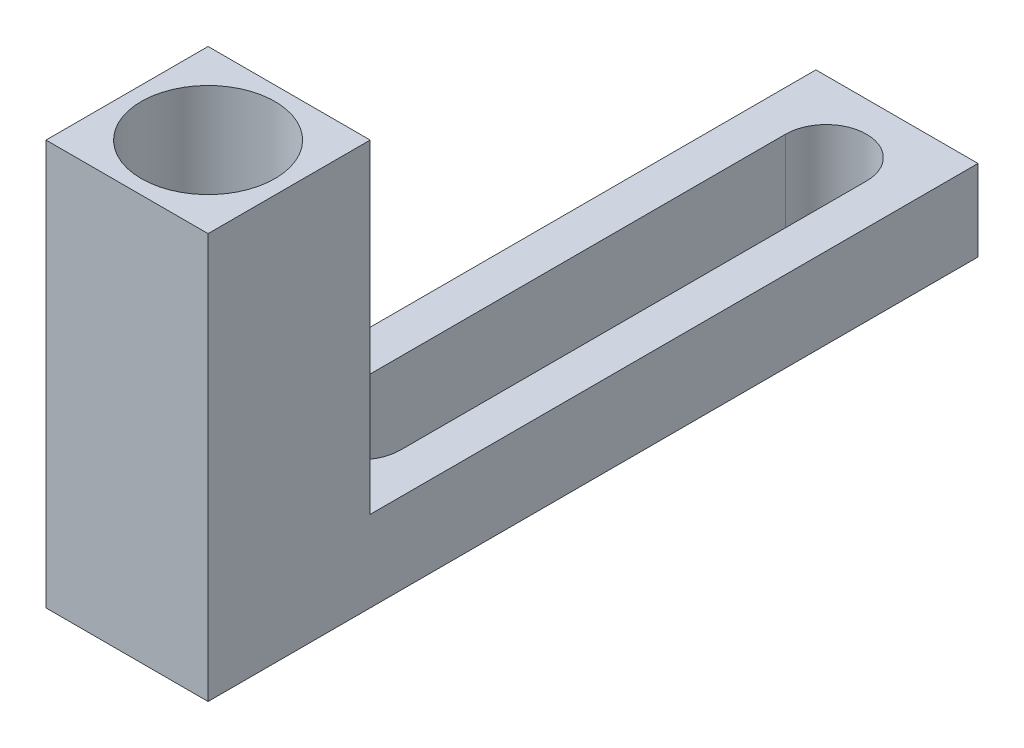
ISO-10303-21;
HEADER;
FILE_DESCRIPTION(('STEP AP214'),'2;1');
FILE_NAME('part.step','',(''),(''),'','','');
FILE_SCHEMA(('AUTOMOTIVE_DESIGN { 1 0 10303 214 1 1 1 1 }'));
ENDSEC;
DATA;
#1=APPLICATION_CONTEXT('core data for automotive mechanical design processes');
#2=APPLICATION_PROTOCOL_DEFINITION('international standard','automotive_design',2000,#1);
#3=PRODUCT_CONTEXT('',#1,'mechanical');
#4=PRODUCT('Part','Part','',(#3));
#5=PRODUCT_RELATED_PRODUCT_CATEGORY('part','',(#4));
#6=PRODUCT_DEFINITION_FORMATION('','',#4);
#7=PRODUCT_DEFINITION_CONTEXT('part definition',#1,'design');
#8=PRODUCT_DEFINITION('design','',#6,#7);
#9=PRODUCT_DEFINITION_SHAPE('','',#8);
#10=(LENGTH_UNIT() NAMED_UNIT(*) SI_UNIT(.MILLI.,.METRE.));
#11=(NAMED_UNIT(*) PLANE_ANGLE_UNIT() SI_UNIT($,.RADIAN.));
#12=(NAMED_UNIT(*) SI_UNIT($,.STERADIAN.) SOLID_ANGLE_UNIT());
#13=UNCERTAINTY_MEASURE_WITH_UNIT(LENGTH_MEASURE(1.E-05),#10,'distance_accuracy_value','');
#14=(GEOMETRIC_REPRESENTATION_CONTEXT(3) GLOBAL_UNCERTAINTY_ASSIGNED_CONTEXT((#13)) GLOBAL_UNIT_ASSIGNED_CONTEXT((#10,
#11,#12)) REPRESENTATION_CONTEXT('',''));
#15=CARTESIAN_POINT('',(0.,0.,0.));
#16=DIRECTION('',(0.,0.,1.));
#17=DIRECTION('',(1.,0.,0.));
#18=AXIS2_PLACEMENT_3D('',#15,#16,#17);
#19=CARTESIAN_POINT('',(0.,4.,0.));
#20=DIRECTION('',(0.,-1.,0.));
#21=DIRECTION('',(0.,0.,-1.));
#22=AXIS2_PLACEMENT_3D('',#19,#20,#21);
#23=PLANE('',#22);
#24=DIRECTION('',(0.,0.,-1.));
#25=VECTOR('',#24,1.);
#26=CARTESIAN_POINT('',(4.,4.,15.));
#27=LINE('',#26,#25);
#28=CARTESIAN_POINT('',(4.,4.,15.));
#29=VERTEX_POINT('',#28);
#30=CARTESIAN_POINT('',(4.,4.,-15.));
#31=VERTEX_POINT('',#30);
#32=EDGE_CURVE('E217',#29,#31,#27,.T.);
#33=ORIENTED_EDGE('',*,*,#32,.T.);
#34=DIRECTION('',(-1.,0.,0.));
#35=VECTOR('',#34,1.);
#36=CARTESIAN_POINT('',(-4.,4.,-15.));
#37=LINE('',#36,#35);
#38=CARTESIAN_POINT('',(-4.,4.,-15.));
#39=VERTEX_POINT('',#38);
#40=EDGE_CURVE('E220',#31,#39,#37,.T.);
#41=ORIENTED_EDGE('',*,*,#40,.T.);
#42=DIRECTION('',(0.,0.,1.));
#43=VECTOR('',#42,1.);
#44=CARTESIAN_POINT('',(-4.,4.,15.));
#45=LINE('',#44,#43);
#46=CARTESIAN_POINT('',(-4.,4.,15.));
#47=VERTEX_POINT('',#46);
#48=EDGE_CURVE('E223',#39,#47,#45,.T.);
#49=ORIENTED_EDGE('',*,*,#48,.T.);
#50=DIRECTION('',(1.,0.,0.));
#51=VECTOR('',#50,1.);
#52=CARTESIAN_POINT('',(-4.,4.,15.));
#53=LINE('',#52,#51);
#54=EDGE_CURVE('E226',#47,#29,#53,.T.);
#55=ORIENTED_EDGE('',*,*,#54,.T.);
#56=EDGE_LOOP('',(#33,#41,#49,#55));
#57=FACE_BOUND('',#56,.T.);
#58=CARTESIAN_POINT('',(0.,4.,11.5));
#59=DIRECTION('',(0.,1.,0.));
#60=DIRECTION('',(0.,0.,1.));
#61=AXIS2_PLACEMENT_3D('',#58,#59,#60);
#62=CIRCLE('',#61,2.);
#63=CARTESIAN_POINT('',(-2.,4.,11.5));
#64=VERTEX_POINT('',#63);
#65=CARTESIAN_POINT('',(2.,4.,11.5));
#66=VERTEX_POINT('',#65);
#67=EDGE_CURVE('E186',#64,#66,#62,.T.);
#68=ORIENTED_EDGE('',*,*,#67,.F.);
#69=DIRECTION('',(0.,0.,1.));
#70=VECTOR('',#69,1.);
#71=CARTESIAN_POINT('',(-2.,4.,11.5));
#72=LINE('',#71,#70);
#73=CARTESIAN_POINT('',(-2.,4.,-11.5));
#74=VERTEX_POINT('',#73);
#75=EDGE_CURVE('E194',#74,#64,#72,.T.);
#76=ORIENTED_EDGE('',*,*,#75,.F.);
#77=CARTESIAN_POINT('',(0.,4.,-11.5));
#78=DIRECTION('',(0.,1.,0.));
#79=DIRECTION('',(0.,0.,1.));
#80=AXIS2_PLACEMENT_3D('',#77,#78,#79);
#81=CIRCLE('',#80,2.);
#82=CARTESIAN_POINT('',(2.,4.,-11.5));
#83=VERTEX_POINT('',#82);
#84=EDGE_CURVE('E191',#83,#74,#81,.T.);
#85=ORIENTED_EDGE('',*,*,#84,.F.);
#86=DIRECTION('',(0.,0.,-1.));
#87=VECTOR('',#86,1.);
#88=CARTESIAN_POINT('',(2.,4.,11.5));
#89=LINE('',#88,#87);
#90=EDGE_CURVE('E188',#66,#83,#89,.T.);
#91=ORIENTED_EDGE('',*,*,#90,.F.);
#92=EDGE_LOOP('',(#68,#76,#85,#91));
#93=FACE_BOUND('',#92,.T.);
#94=ADVANCED_FACE('F37',(#57,#93),#23,.F.);
#95=CARTESIAN_POINT('',(0.,0.,0.));
#96=DIRECTION('',(0.,-1.,0.));
#97=DIRECTION('',(0.,0.,-1.));
#98=AXIS2_PLACEMENT_3D('',#95,#96,#97);
#99=PLANE('',#98);
#100=DIRECTION('',(0.,0.,-1.));
#101=VECTOR('',#100,1.);
#102=CARTESIAN_POINT('',(4.,0.,15.));
#103=LINE('',#102,#101);
#104=CARTESIAN_POINT('',(4.,0.,23.));
#105=VERTEX_POINT('',#104);
#106=CARTESIAN_POINT('',(4.,0.,-15.));
#107=VERTEX_POINT('',#106);
#108=EDGE_CURVE('E216',#105,#107,#103,.T.);
#109=ORIENTED_EDGE('',*,*,#108,.F.);
#110=DIRECTION('',(1.,0.,0.));
#111=VECTOR('',#110,1.);
#112=CARTESIAN_POINT('',(-4.,0.,23.));
#113=LINE('',#112,#111);
#114=CARTESIAN_POINT('',(-4.,0.,23.));
#115=VERTEX_POINT('',#114);
#116=EDGE_CURVE('E156',#115,#105,#113,.T.);
#117=ORIENTED_EDGE('',*,*,#116,.F.);
#118=DIRECTION('',(0.,0.,1.));
#119=VECTOR('',#118,1.);
#120=CARTESIAN_POINT('',(-4.,0.,15.));
#121=LINE('',#120,#119);
#122=CARTESIAN_POINT('',(-4.,0.,-15.));
#123=VERTEX_POINT('',#122);
#124=EDGE_CURVE('E221',#123,#115,#121,.T.);
#125=ORIENTED_EDGE('',*,*,#124,.F.);
#126=DIRECTION('',(-1.,0.,0.));
#127=VECTOR('',#126,1.);
#128=CARTESIAN_POINT('',(-4.,0.,-15.));
#129=LINE('',#128,#127);
#130=EDGE_CURVE('E231',#107,#123,#129,.T.);
#131=ORIENTED_EDGE('',*,*,#130,.F.);
#132=EDGE_LOOP('',(#109,#117,#125,#131));
#133=FACE_BOUND('',#132,.T.);
#134=DIRECTION('',(0.,0.,1.));
#135=VECTOR('',#134,1.);
#136=CARTESIAN_POINT('',(-2.,0.,11.5));
#137=LINE('',#136,#135);
#138=CARTESIAN_POINT('',(-2.,0.,-11.5));
#139=VERTEX_POINT('',#138);
#140=CARTESIAN_POINT('',(-2.,0.,11.5));
#141=VERTEX_POINT('',#140);
#142=EDGE_CURVE('E189',#139,#141,#137,.T.);
#143=ORIENTED_EDGE('',*,*,#142,.T.);
#144=CARTESIAN_POINT('',(0.,0.,11.5));
#145=DIRECTION('',(0.,1.,0.));
#146=DIRECTION('',(0.,0.,1.));
#147=AXIS2_PLACEMENT_3D('',#144,#145,#146);
#148=CIRCLE('',#147,2.);
#149=CARTESIAN_POINT('',(2.,0.,11.5));
#150=VERTEX_POINT('',#149);
#151=EDGE_CURVE('E185',#141,#150,#148,.T.);
#152=ORIENTED_EDGE('',*,*,#151,.T.);
#153=DIRECTION('',(0.,0.,-1.));
#154=VECTOR('',#153,1.);
#155=CARTESIAN_POINT('',(2.,0.,11.5));
#156=LINE('',#155,#154);
#157=CARTESIAN_POINT('',(2.,0.,-11.5));
#158=VERTEX_POINT('',#157);
#159=EDGE_CURVE('E199',#150,#158,#156,.T.);
#160=ORIENTED_EDGE('',*,*,#159,.T.);
#161=CARTESIAN_POINT('',(0.,0.,-11.5));
#162=DIRECTION('',(0.,1.,0.));
#163=DIRECTION('',(0.,0.,1.));
#164=AXIS2_PLACEMENT_3D('',#161,#162,#163);
#165=CIRCLE('',#164,2.);
#166=EDGE_CURVE('E202',#158,#139,#165,.T.);
#167=ORIENTED_EDGE('',*,*,#166,.T.);
#168=EDGE_LOOP('',(#143,#152,#160,#167));
#169=FACE_BOUND('',#168,.T.);
#170=ADVANCED_FACE('F243',(#133,#169),#99,.T.);
#171=CARTESIAN_POINT('',(4.,4.,15.));
#172=DIRECTION('',(-1.,0.,0.));
#173=DIRECTION('',(0.,0.,1.));
#174=AXIS2_PLACEMENT_3D('',#171,#172,#173);
#175=PLANE('',#174);
#176=ORIENTED_EDGE('',*,*,#108,.T.);
#177=DIRECTION('',(0.,-1.,0.));
#178=VECTOR('',#177,1.);
#179=CARTESIAN_POINT('',(4.,4.,-15.));
#180=LINE('',#179,#178);
#181=EDGE_CURVE('E12',#31,#107,#180,.T.);
#182=ORIENTED_EDGE('',*,*,#181,.F.);
#183=ORIENTED_EDGE('',*,*,#32,.F.);
#184=DIRECTION('',(0.,-1.,0.));
#185=VECTOR('',#184,1.);
#186=CARTESIAN_POINT('',(4.,20.,15.));
#187=LINE('',#186,#185);
#188=CARTESIAN_POINT('',(4.,20.,15.));
#189=VERTEX_POINT('',#188);
#190=EDGE_CURVE('E177',#189,#29,#187,.T.);
#191=ORIENTED_EDGE('',*,*,#190,.F.);
#192=DIRECTION('',(0.,0.,-1.));
#193=VECTOR('',#192,1.);
#194=CARTESIAN_POINT('',(4.,20.,15.));
#195=LINE('',#194,#193);
#196=CARTESIAN_POINT('',(4.,20.,23.));
#197=VERTEX_POINT('',#196);
#198=EDGE_CURVE('E170',#197,#189,#195,.T.);
#199=ORIENTED_EDGE('',*,*,#198,.F.);
#200=DIRECTION('',(0.,-1.,0.));
#201=VECTOR('',#200,1.);
#202=CARTESIAN_POINT('',(4.,20.,23.));
#203=LINE('',#202,#201);
#204=EDGE_CURVE('E179',#197,#105,#203,.T.);
#205=ORIENTED_EDGE('',*,*,#204,.T.);
#206=EDGE_LOOP('',(#176,#182,#183,#191,#199,#205));
#207=FACE_BOUND('',#206,.T.);
#208=ADVANCED_FACE('F39',(#207),#175,.F.);
#209=CARTESIAN_POINT('',(-4.,4.,-15.));
#210=DIRECTION('',(0.,0.,1.));
#211=DIRECTION('',(1.,0.,0.));
#212=AXIS2_PLACEMENT_3D('',#209,#210,#211);
#213=PLANE('',#212);
#214=ORIENTED_EDGE('',*,*,#130,.T.);
#215=DIRECTION('',(0.,-1.,0.));
#216=VECTOR('',#215,1.);
#217=CARTESIAN_POINT('',(-4.,4.,-15.));
#218=LINE('',#217,#216);
#219=EDGE_CURVE('E45',#39,#123,#218,.T.);
#220=ORIENTED_EDGE('',*,*,#219,.F.);
#221=ORIENTED_EDGE('',*,*,#40,.F.);
#222=ORIENTED_EDGE('',*,*,#181,.T.);
#223=EDGE_LOOP('',(#214,#220,#221,#222));
#224=FACE_BOUND('',#223,.T.);
#225=ADVANCED_FACE('F262',(#224),#213,.F.);
#226=CARTESIAN_POINT('',(-4.,4.,15.));
#227=DIRECTION('',(1.,0.,0.));
#228=DIRECTION('',(0.,0.,-1.));
#229=AXIS2_PLACEMENT_3D('',#226,#227,#228);
#230=PLANE('',#229);
#231=CARTESIAN_POINT('',(-4.,6.,18.5));
#232=DIRECTION('',(-1.,0.,0.));
#233=DIRECTION('',(0.,0.,1.));
#234=AXIS2_PLACEMENT_3D('',#231,#232,#233);
#235=CIRCLE('',#234,1.5);
#236=CARTESIAN_POINT('',(-4.,7.5,18.5));
#237=VERTEX_POINT('',#236);
#238=CARTESIAN_POINT('',(-4.,4.5,18.5));
#239=VERTEX_POINT('',#238);
#240=EDGE_CURVE('E335',#237,#239,#235,.T.);
#241=ORIENTED_EDGE('',*,*,#240,.F.);
#242=DIRECTION('',(0.,0.,-1.));
#243=VECTOR('',#242,1.);
#244=CARTESIAN_POINT('',(-4.,7.5,19.5));
#245=LINE('',#244,#243);
#246=CARTESIAN_POINT('',(-4.,7.5,19.5));
#247=VERTEX_POINT('',#246);
#248=EDGE_CURVE('E332',#247,#237,#245,.T.);
#249=ORIENTED_EDGE('',*,*,#248,.F.);
#250=CARTESIAN_POINT('',(-4.,6.,19.5));
#251=DIRECTION('',(-1.,0.,0.));
#252=DIRECTION('',(0.,0.,1.));
#253=AXIS2_PLACEMENT_3D('',#250,#251,#252);
#254=CIRCLE('',#253,1.5);
#255=CARTESIAN_POINT('',(-4.,4.5,19.5));
#256=VERTEX_POINT('',#255);
#257=EDGE_CURVE('E320',#256,#247,#254,.T.);
#258=ORIENTED_EDGE('',*,*,#257,.F.);
#259=DIRECTION('',(0.,0.,1.));
#260=VECTOR('',#259,1.);
#261=CARTESIAN_POINT('',(-4.,4.5,19.5));
#262=LINE('',#261,#260);
#263=EDGE_CURVE('E52',#239,#256,#262,.T.);
#264=ORIENTED_EDGE('',*,*,#263,.F.);
#265=EDGE_LOOP('',(#241,#249,#258,#264));
#266=FACE_BOUND('',#265,.T.);
#267=ORIENTED_EDGE('',*,*,#124,.T.);
#268=DIRECTION('',(0.,-1.,0.));
#269=VECTOR('',#268,1.);
#270=CARTESIAN_POINT('',(-4.,20.,23.));
#271=LINE('',#270,#269);
#272=CARTESIAN_POINT('',(-4.,20.,23.));
#273=VERTEX_POINT('',#272);
#274=EDGE_CURVE('E182',#273,#115,#271,.T.);
#275=ORIENTED_EDGE('',*,*,#274,.F.);
#276=DIRECTION('',(0.,0.,1.));
#277=VECTOR('',#276,1.);
#278=CARTESIAN_POINT('',(-4.,20.,15.));
#279=LINE('',#278,#277);
#280=CARTESIAN_POINT('',(-4.,20.,15.));
#281=VERTEX_POINT('',#280);
#282=EDGE_CURVE('E160',#281,#273,#279,.T.);
#283=ORIENTED_EDGE('',*,*,#282,.F.);
#284=DIRECTION('',(0.,-1.,0.));
#285=VECTOR('',#284,1.);
#286=CARTESIAN_POINT('',(-4.,20.,15.));
#287=LINE('',#286,#285);
#288=EDGE_CURVE('E173',#281,#47,#287,.T.);
#289=ORIENTED_EDGE('',*,*,#288,.T.);
#290=ORIENTED_EDGE('',*,*,#48,.F.);
#291=ORIENTED_EDGE('',*,*,#219,.T.);
#292=EDGE_LOOP('',(#267,#275,#283,#289,#290,#291));
#293=FACE_BOUND('',#292,.T.);
#294=ADVANCED_FACE('F238',(#266,#293),#230,.F.);
#295=CARTESIAN_POINT('',(0.,4.,11.5));
#296=DIRECTION('',(0.,-1.,0.));
#297=DIRECTION('',(0.,0.,-1.));
#298=AXIS2_PLACEMENT_3D('',#295,#296,#297);
#299=CYLINDRICAL_SURFACE('',#298,2.);
#300=ORIENTED_EDGE('',*,*,#151,.F.);
#301=DIRECTION('',(0.,-1.,0.));
#302=VECTOR('',#301,1.);
#303=CARTESIAN_POINT('',(-2.,4.,11.5));
#304=LINE('',#303,#302);
#305=EDGE_CURVE('E196',#64,#141,#304,.T.);
#306=ORIENTED_EDGE('',*,*,#305,.F.);
#307=ORIENTED_EDGE('',*,*,#67,.T.);
#308=DIRECTION('',(0.,-1.,0.));
#309=VECTOR('',#308,1.);
#310=CARTESIAN_POINT('',(2.,4.,11.5));
#311=LINE('',#310,#309);
#312=EDGE_CURVE('E213',#66,#150,#311,.T.);
#313=ORIENTED_EDGE('',*,*,#312,.T.);
#314=EDGE_LOOP('',(#300,#306,#307,#313));
#315=FACE_BOUND('',#314,.T.);
#316=ADVANCED_FACE('F268',(#315),#299,.F.);
#317=CARTESIAN_POINT('',(2.,4.,11.5));
#318=DIRECTION('',(-1.,0.,0.));
#319=DIRECTION('',(0.,0.,1.));
#320=AXIS2_PLACEMENT_3D('',#317,#318,#319);
#321=PLANE('',#320);
#322=ORIENTED_EDGE('',*,*,#159,.F.);
#323=ORIENTED_EDGE('',*,*,#312,.F.);
#324=ORIENTED_EDGE('',*,*,#90,.T.);
#325=DIRECTION('',(0.,-1.,0.));
#326=VECTOR('',#325,1.);
#327=CARTESIAN_POINT('',(2.,4.,-11.5));
#328=LINE('',#327,#326);
#329=EDGE_CURVE('E211',#83,#158,#328,.T.);
#330=ORIENTED_EDGE('',*,*,#329,.T.);
#331=EDGE_LOOP('',(#322,#323,#324,#330));
#332=FACE_BOUND('',#331,.T.);
#333=ADVANCED_FACE('F280',(#332),#321,.T.);
#334=CARTESIAN_POINT('',(0.,4.,-11.5));
#335=DIRECTION('',(0.,-1.,0.));
#336=DIRECTION('',(0.,0.,-1.));
#337=AXIS2_PLACEMENT_3D('',#334,#335,#336);
#338=CYLINDRICAL_SURFACE('',#337,2.);
#339=ORIENTED_EDGE('',*,*,#166,.F.);
#340=ORIENTED_EDGE('',*,*,#329,.F.);
#341=ORIENTED_EDGE('',*,*,#84,.T.);
#342=DIRECTION('',(0.,-1.,0.));
#343=VECTOR('',#342,1.);
#344=CARTESIAN_POINT('',(-2.,4.,-11.5));
#345=LINE('',#344,#343);
#346=EDGE_CURVE('E209',#74,#139,#345,.T.);
#347=ORIENTED_EDGE('',*,*,#346,.T.);
#348=EDGE_LOOP('',(#339,#340,#341,#347));
#349=FACE_BOUND('',#348,.T.);
#350=ADVANCED_FACE('F284',(#349),#338,.F.);
#351=CARTESIAN_POINT('',(-2.,4.,11.5));
#352=DIRECTION('',(1.,0.,0.));
#353=DIRECTION('',(0.,0.,-1.));
#354=AXIS2_PLACEMENT_3D('',#351,#352,#353);
#355=PLANE('',#354);
#356=ORIENTED_EDGE('',*,*,#142,.F.);
#357=ORIENTED_EDGE('',*,*,#346,.F.);
#358=ORIENTED_EDGE('',*,*,#75,.T.);
#359=ORIENTED_EDGE('',*,*,#305,.T.);
#360=EDGE_LOOP('',(#356,#357,#358,#359));
#361=FACE_BOUND('',#360,.T.);
#362=ADVANCED_FACE('F288',(#361),#355,.T.);
#363=CARTESIAN_POINT('',(-4.,20.,23.));
#364=DIRECTION('',(0.,0.,-1.));
#365=DIRECTION('',(-1.,0.,0.));
#366=AXIS2_PLACEMENT_3D('',#363,#364,#365);
#367=PLANE('',#366);
#368=ORIENTED_EDGE('',*,*,#116,.T.);
#369=ORIENTED_EDGE('',*,*,#204,.F.);
#370=DIRECTION('',(1.,0.,0.));
#371=VECTOR('',#370,1.);
#372=CARTESIAN_POINT('',(-4.,20.,23.));
#373=LINE('',#372,#371);
#374=EDGE_CURVE('E168',#273,#197,#373,.T.);
#375=ORIENTED_EDGE('',*,*,#374,.F.);
#376=ORIENTED_EDGE('',*,*,#274,.T.);
#377=EDGE_LOOP('',(#368,#369,#375,#376));
#378=FACE_BOUND('',#377,.T.);
#379=ADVANCED_FACE('F247',(#378),#367,.F.);
#380=CARTESIAN_POINT('',(-4.,20.,15.));
#381=DIRECTION('',(0.,0.,1.));
#382=DIRECTION('',(1.,0.,0.));
#383=AXIS2_PLACEMENT_3D('',#380,#381,#382);
#384=PLANE('',#383);
#385=ORIENTED_EDGE('',*,*,#54,.F.);
#386=ORIENTED_EDGE('',*,*,#288,.F.);
#387=DIRECTION('',(-1.,0.,0.));
#388=VECTOR('',#387,1.);
#389=CARTESIAN_POINT('',(-4.,20.,15.));
#390=LINE('',#389,#388);
#391=EDGE_CURVE('E172',#189,#281,#390,.T.);
#392=ORIENTED_EDGE('',*,*,#391,.F.);
#393=ORIENTED_EDGE('',*,*,#190,.T.);
#394=EDGE_LOOP('',(#385,#386,#392,#393));
#395=FACE_BOUND('',#394,.T.);
#396=ADVANCED_FACE('F256',(#395),#384,.F.);
#397=CARTESIAN_POINT('',(0.,20.,0.));
#398=DIRECTION('',(0.,1.,0.));
#399=DIRECTION('',(0.,0.,1.));
#400=AXIS2_PLACEMENT_3D('',#397,#398,#399);
#401=PLANE('',#400);
#402=CARTESIAN_POINT('',(0.,20.,19.));
#403=DIRECTION('',(0.,1.,0.));
#404=DIRECTION('',(0.,0.,1.));
#405=AXIS2_PLACEMENT_3D('',#402,#403,#404);
#406=CIRCLE('',#405,3.3);
#407=CARTESIAN_POINT('',(0.,20.,22.3));
#408=VERTEX_POINT('',#407);
#409=EDGE_CURVE('E157',#408,#408,#406,.T.);
#410=ORIENTED_EDGE('',*,*,#409,.F.);
#411=EDGE_LOOP('',(#410));
#412=FACE_BOUND('',#411,.T.);
#413=ORIENTED_EDGE('',*,*,#282,.T.);
#414=ORIENTED_EDGE('',*,*,#374,.T.);
#415=ORIENTED_EDGE('',*,*,#198,.T.);
#416=ORIENTED_EDGE('',*,*,#391,.T.);
#417=EDGE_LOOP('',(#413,#414,#415,#416));
#418=FACE_BOUND('',#417,.T.);
#419=ADVANCED_FACE('F251',(#412,#418),#401,.T.);
#420=CARTESIAN_POINT('',(0.,4.5,0.));
#421=DIRECTION('',(0.,-1.,0.));
#422=DIRECTION('',(0.,0.,-1.));
#423=AXIS2_PLACEMENT_3D('',#420,#421,#422);
#424=PLANE('',#423);
#425=CARTESIAN_POINT('',(0.,4.5,19.));
#426=DIRECTION('',(0.,-1.,0.));
#427=DIRECTION('',(0.,0.,-1.));
#428=AXIS2_PLACEMENT_3D('',#425,#426,#427);
#429=CIRCLE('',#428,3.3);
#430=CARTESIAN_POINT('',(-3.26190128606002,4.5,19.5));
#431=VERTEX_POINT('',#430);
#432=CARTESIAN_POINT('',(-3.26190128606002,4.5,18.5));
#433=VERTEX_POINT('',#432);
#434=EDGE_CURVE('E140',#431,#433,#429,.F.);
#435=ORIENTED_EDGE('',*,*,#434,.T.);
#436=DIRECTION('',(-1.,0.,0.));
#437=VECTOR('',#436,1.);
#438=CARTESIAN_POINT('',(4.001,4.5,18.5));
#439=LINE('',#438,#437);
#440=EDGE_CURVE('E145',#433,#239,#439,.T.);
#441=ORIENTED_EDGE('',*,*,#440,.T.);
#442=ORIENTED_EDGE('',*,*,#263,.T.);
#443=DIRECTION('',(-1.,0.,0.));
#444=VECTOR('',#443,1.);
#445=CARTESIAN_POINT('',(4.001,4.5,19.5));
#446=LINE('',#445,#444);
#447=EDGE_CURVE('E136',#431,#256,#446,.T.);
#448=ORIENTED_EDGE('',*,*,#447,.F.);
#449=EDGE_LOOP('',(#435,#441,#442,#448));
#450=FACE_BOUND('',#449,.T.);
#451=ADVANCED_FACE('F138',(#450),#424,.F.);
#452=CARTESIAN_POINT('',(0.,-9.33380951166243,19.));
#453=DIRECTION('',(0.,1.,0.));
#454=DIRECTION('',(0.,0.,1.));
#455=AXIS2_PLACEMENT_3D('',#452,#453,#454);
#456=CYLINDRICAL_SURFACE('',#455,3.3);
#457=ORIENTED_EDGE('',*,*,#409,.T.);
#458=EDGE_LOOP('',(#457));
#459=FACE_BOUND('',#458,.T.);
#460=CARTESIAN_POINT('',(0.,7.5,19.));
#461=DIRECTION('',(0.,1.,0.));
#462=DIRECTION('',(0.,0.,1.));
#463=AXIS2_PLACEMENT_3D('',#460,#461,#462);
#464=CIRCLE('',#463,3.3);
#465=CARTESIAN_POINT('',(-3.26190128606002,7.5,18.5));
#466=VERTEX_POINT('',#465);
#467=CARTESIAN_POINT('',(-3.26190128606002,7.5,19.5));
#468=VERTEX_POINT('',#467);
#469=EDGE_CURVE('E60',#466,#468,#464,.T.);
#470=ORIENTED_EDGE('',*,*,#469,.F.);
#471=CARTESIAN_POINT('',(-3.26190128606002,4.5,18.5));
#472=CARTESIAN_POINT('',(-3.25549258349245,4.4999981345327,18.45816115808));
#473=CARTESIAN_POINT('',(-3.24827329783223,4.50175127973328,18.4164737980513));
#474=CARTESIAN_POINT('',(-3.23230892254729,4.50866862310489,18.3337045780305));
#475=CARTESIAN_POINT('',(-3.223564801672,4.51383066132613,18.2926223514523));
#476=CARTESIAN_POINT('',(-3.19528823470046,4.53420315477997,18.1711468467012));
#477=CARTESIAN_POINT('',(-3.17363216306163,4.55430255995249,18.0920146035009));
#478=CARTESIAN_POINT('',(-3.12596377295469,4.60633850974047,17.9394603199369));
#479=CARTESIAN_POINT('',(-3.09996125688089,4.63824861042848,17.8660259630766));
#480=CARTESIAN_POINT('',(-3.0450329474232,4.71275241626502,17.7258531419291));
#481=CARTESIAN_POINT('',(-3.01610247880595,4.75536337404663,17.6591257366749));
#482=CARTESIAN_POINT('',(-2.95449329884567,4.85430432473003,17.5280425478984));
#483=CARTESIAN_POINT('',(-2.92170701196744,4.91150310593591,17.4643931958305));
#484=CARTESIAN_POINT('',(-2.8571936535426,5.03618235012548,17.3474557551626));
#485=CARTESIAN_POINT('',(-2.82546640527346,5.10366108712317,17.294165930629));
#486=CARTESIAN_POINT('',(-2.76940519432662,5.23960201180191,17.2047695965206));
#487=CARTESIAN_POINT('',(-2.74464053765389,5.30704449342948,17.1673875777938));
#488=CARTESIAN_POINT('',(-2.70051640254077,5.44835601270779,17.1029655369855));
#489=CARTESIAN_POINT('',(-2.68115245366135,5.52221966839136,17.0759169544966));
#490=CARTESIAN_POINT('',(-2.65007843701948,5.67557487716237,17.0333276545716));
#491=CARTESIAN_POINT('',(-2.63843969537129,5.75511156612495,17.0178940069177));
#492=CARTESIAN_POINT('',(-2.62501502314783,5.91642924567695,17.0001411025467));
#493=CARTESIAN_POINT('',(-2.62321762960374,5.99820751364637,16.9978065881913));
#494=CARTESIAN_POINT('',(-2.62925282404158,6.14832050326834,17.0057498862476));
#495=CARTESIAN_POINT('',(-2.63567425589892,6.21682303291626,17.014179072477));
#496=CARTESIAN_POINT('',(-2.65498793564948,6.35115045196028,17.040077197659));
#497=CARTESIAN_POINT('',(-2.66788306710305,6.41697413398816,17.0575501650632));
#498=CARTESIAN_POINT('',(-2.69913205213923,6.54601087867664,17.1012067084092));
#499=CARTESIAN_POINT('',(-2.71760395244647,6.60912986553922,17.1275802763337));
#500=CARTESIAN_POINT('',(-2.75826467291882,6.73025556763554,17.1880116576046));
#501=CARTESIAN_POINT('',(-2.78045484014212,6.78826041844896,17.222072257375));
#502=CARTESIAN_POINT('',(-2.83139713298503,6.90895569995419,17.3041425389997));
#503=CARTESIAN_POINT('',(-2.86060030772971,6.97049328579637,17.3535696821856));
#504=CARTESIAN_POINT('',(-2.91991018111708,7.08492981410847,17.4611990038312));
#505=CARTESIAN_POINT('',(-2.95001785150811,7.1378190414403,17.5194109114691));
#506=CARTESIAN_POINT('',(-3.01327095788953,7.2407181644657,17.652290359831));
#507=CARTESIAN_POINT('',(-3.04626553334321,7.28933444241119,17.7281199230652));
#508=CARTESIAN_POINT('',(-3.108336112415,7.37262727463678,17.8884206902633));
#509=CARTESIAN_POINT('',(-3.13741883849036,7.40732795145917,17.9728766187397));
#510=CARTESIAN_POINT('',(-3.18424871098192,7.45563654707595,18.1305833554397));
#511=CARTESIAN_POINT('',(-3.20309852406251,7.47209610661503,18.2026291471564));
#512=CARTESIAN_POINT('',(-3.22787281397382,7.4887373511763,18.3127837440657));
#513=CARTESIAN_POINT('',(-3.23555883551194,7.49294337222349,18.3499226552922));
#514=CARTESIAN_POINT('',(-3.24968378868227,7.49857641206396,18.4246679801001));
#515=CARTESIAN_POINT('',(-3.25612197357056,7.50000177141987,18.4622746593724));
#516=CARTESIAN_POINT('',(-3.26190128606002,7.5,18.5));
#517=B_SPLINE_CURVE_WITH_KNOTS('',3,(#471,#472,#473,#474,#475,#476,#477,#478,#479,#480,#481,
#482,#483,#484,#485,#486,#487,#488,#489,#490,#491,#492,#493,#494,#495,#496,#497,#498,#499,#500,
#501,#502,#503,#504,#505,#506,#507,#508,#509,#510,#511,#512,#513,#514,#515,#516),.UNSPECIFIED.,
.F.,.F.,(4,2,2,2,2,2,2,2,2,2,2,2,2,2,2,2,2,2,2,2,2,2,4),(0.,0.126886754194115,0.253693187184841,
0.505778878435014,0.757303535557366,1.00923635059384,1.28299781029049,1.55671335648681,
1.79871687895806,2.04051948430012,2.2845246758911,2.52824559546578,2.7352179918982,
2.94228266132239,3.15408078951454,3.36595581474136,3.61745989781795,3.8692445955359,
4.15561749086238,4.44149179344165,4.66934213921547,4.78370573264952,4.89813755489248),.UNSPECIFIED.);
#518=EDGE_CURVE('E151',#433,#466,#517,.T.);
#519=ORIENTED_EDGE('',*,*,#518,.F.);
#520=ORIENTED_EDGE('',*,*,#434,.F.);
#521=CARTESIAN_POINT('',(-3.26190128606002,7.5,19.5));
#522=CARTESIAN_POINT('',(-3.25549258349245,7.5000018654673,19.54183884192));
#523=CARTESIAN_POINT('',(-3.24827329783223,7.49824872026672,19.5835262019487));
#524=CARTESIAN_POINT('',(-3.23230892254729,7.49133137689511,19.6662954219695));
#525=CARTESIAN_POINT('',(-3.223564801672,7.48616933867387,19.7073776485477));
#526=CARTESIAN_POINT('',(-3.19528823470046,7.46579684522003,19.8288531532988));
#527=CARTESIAN_POINT('',(-3.17363216306163,7.44569744004751,19.9079853964991));
#528=CARTESIAN_POINT('',(-3.12596377295469,7.39366149025953,20.0605396800631));
#529=CARTESIAN_POINT('',(-3.09996125688089,7.36175138957152,20.1339740369234));
#530=CARTESIAN_POINT('',(-3.0450329474232,7.28724758373498,20.2741468580709));
#531=CARTESIAN_POINT('',(-3.01610247880595,7.24463662595337,20.3408742633251));
#532=CARTESIAN_POINT('',(-2.95449329884567,7.14569567526997,20.4719574521016));
#533=CARTESIAN_POINT('',(-2.92170701196744,7.08849689406409,20.5356068041695));
#534=CARTESIAN_POINT('',(-2.8571936535426,6.96381764987452,20.6525442448374));
#535=CARTESIAN_POINT('',(-2.82546640527346,6.89633891287683,20.705834069371));
#536=CARTESIAN_POINT('',(-2.76940519432662,6.76039798819809,20.7952304034794));
#537=CARTESIAN_POINT('',(-2.74464053765389,6.69295550657052,20.8326124222062));
#538=CARTESIAN_POINT('',(-2.70051640254077,6.55164398729221,20.8970344630145));
#539=CARTESIAN_POINT('',(-2.68115245366135,6.47778033160864,20.9240830455034));
#540=CARTESIAN_POINT('',(-2.65007843701948,6.32442512283763,20.9666723454284));
#541=CARTESIAN_POINT('',(-2.63843969537129,6.24488843387505,20.9821059930823));
#542=CARTESIAN_POINT('',(-2.62501502314783,6.08357075432305,20.9998588974533));
#543=CARTESIAN_POINT('',(-2.62321762960374,6.00179248635363,21.0021934118087));
#544=CARTESIAN_POINT('',(-2.62925282404158,5.85167949673166,20.9942501137524));
#545=CARTESIAN_POINT('',(-2.63567425589892,5.78317696708374,20.985820927523));
#546=CARTESIAN_POINT('',(-2.65498793564948,5.64884954803972,20.959922802341));
#547=CARTESIAN_POINT('',(-2.66788306710305,5.58302586601184,20.9424498349368));
#548=CARTESIAN_POINT('',(-2.69913205213923,5.45398912132336,20.8987932915908));
#549=CARTESIAN_POINT('',(-2.71760395244647,5.39087013446079,20.8724197236663));
#550=CARTESIAN_POINT('',(-2.75826467291882,5.26974443236446,20.8119883423954));
#551=CARTESIAN_POINT('',(-2.78045484014212,5.21173958155104,20.777927742625));
#552=CARTESIAN_POINT('',(-2.83139713298503,5.09104430004581,20.6958574610003));
#553=CARTESIAN_POINT('',(-2.86060030772971,5.02950671420363,20.6464303178144));
#554=CARTESIAN_POINT('',(-2.91991018111708,4.91507018589153,20.5388009961688));
#555=CARTESIAN_POINT('',(-2.95001785150811,4.8621809585597,20.4805890885309));
#556=CARTESIAN_POINT('',(-3.01327095788953,4.7592818355343,20.347709640169));
#557=CARTESIAN_POINT('',(-3.04626553334321,4.71066555758881,20.2718800769348));
#558=CARTESIAN_POINT('',(-3.108336112415,4.62737272536322,20.1115793097367));
#559=CARTESIAN_POINT('',(-3.13741883849036,4.59267204854083,20.0271233812603));
#560=CARTESIAN_POINT('',(-3.18424871098192,4.54436345292405,19.8694166445603));
#561=CARTESIAN_POINT('',(-3.20309852406251,4.52790389338497,19.7973708528436));
#562=CARTESIAN_POINT('',(-3.22787281397382,4.5112626488237,19.6872162559343));
#563=CARTESIAN_POINT('',(-3.23555883551194,4.50705662777651,19.6500773447078));
#564=CARTESIAN_POINT('',(-3.24968378868227,4.50142358793604,19.5753320198999));
#565=CARTESIAN_POINT('',(-3.25612197357056,4.49999822858013,19.5377253406276));
#566=CARTESIAN_POINT('',(-3.26190128606002,4.5,19.5));
#567=B_SPLINE_CURVE_WITH_KNOTS('',3,(#521,#522,#523,#524,#525,#526,#527,#528,#529,#530,#531,
#532,#533,#534,#535,#536,#537,#538,#539,#540,#541,#542,#543,#544,#545,#546,#547,#548,#549,#550,
#551,#552,#553,#554,#555,#556,#557,#558,#559,#560,#561,#562,#563,#564,#565,#566),.UNSPECIFIED.,
.F.,.F.,(4,2,2,2,2,2,2,2,2,2,2,2,2,2,2,2,2,2,2,2,2,2,4),(0.,0.126886754194115,0.253693187184841,
0.505778878435014,0.757303535557366,1.00923635059384,1.28299781029049,1.55671335648681,
1.79871687895806,2.04051948430012,2.2845246758911,2.52824559546578,2.73521799189819,
2.94228266132239,3.15408078951454,3.36595581474136,3.61745989781795,3.8692445955359,
4.15561749086238,4.44149179344165,4.66934213921547,4.78370573264951,4.89813755489248),.UNSPECIFIED.);
#568=EDGE_CURVE('E148',#468,#431,#567,.T.);
#569=ORIENTED_EDGE('',*,*,#568,.F.);
#570=EDGE_LOOP('',(#470,#519,#520,#569));
#571=FACE_BOUND('',#570,.T.);
#572=ADVANCED_FACE('F154',(#459,#571),#456,.F.);
#573=CARTESIAN_POINT('',(4.001,7.5,19.5));
#574=DIRECTION('',(0.,1.,0.));
#575=DIRECTION('',(0.,0.,1.));
#576=AXIS2_PLACEMENT_3D('',#573,#574,#575);
#577=PLANE('',#576);
#578=ORIENTED_EDGE('',*,*,#469,.T.);
#579=DIRECTION('',(-1.,0.,0.));
#580=VECTOR('',#579,1.);
#581=CARTESIAN_POINT('',(4.001,7.5,19.5));
#582=LINE('',#581,#580);
#583=EDGE_CURVE('E144',#468,#247,#582,.T.);
#584=ORIENTED_EDGE('',*,*,#583,.T.);
#585=ORIENTED_EDGE('',*,*,#248,.T.);
#586=DIRECTION('',(-1.,0.,0.));
#587=VECTOR('',#586,1.);
#588=CARTESIAN_POINT('',(4.001,7.5,18.5));
#589=LINE('',#588,#587);
#590=EDGE_CURVE('E329',#466,#237,#589,.T.);
#591=ORIENTED_EDGE('',*,*,#590,.F.);
#592=EDGE_LOOP('',(#578,#584,#585,#591));
#593=FACE_BOUND('',#592,.T.);
#594=ADVANCED_FACE('F304',(#593),#577,.F.);
#595=CARTESIAN_POINT('',(4.001,6.,18.5));
#596=DIRECTION('',(-1.,0.,0.));
#597=DIRECTION('',(0.,0.,1.));
#598=AXIS2_PLACEMENT_3D('',#595,#596,#597);
#599=CYLINDRICAL_SURFACE('',#598,1.5);
#600=ORIENTED_EDGE('',*,*,#518,.T.);
#601=ORIENTED_EDGE('',*,*,#590,.T.);
#602=ORIENTED_EDGE('',*,*,#240,.T.);
#603=ORIENTED_EDGE('',*,*,#440,.F.);
#604=EDGE_LOOP('',(#600,#601,#602,#603));
#605=FACE_BOUND('',#604,.T.);
#606=ADVANCED_FACE('F308',(#605),#599,.F.);
#607=CARTESIAN_POINT('',(4.001,6.,19.5));
#608=DIRECTION('',(-1.,0.,0.));
#609=DIRECTION('',(0.,0.,1.));
#610=AXIS2_PLACEMENT_3D('',#607,#608,#609);
#611=CYLINDRICAL_SURFACE('',#610,1.5);
#612=ORIENTED_EDGE('',*,*,#568,.T.);
#613=ORIENTED_EDGE('',*,*,#447,.T.);
#614=ORIENTED_EDGE('',*,*,#257,.T.);
#615=ORIENTED_EDGE('',*,*,#583,.F.);
#616=EDGE_LOOP('',(#612,#613,#614,#615));
#617=FACE_BOUND('',#616,.T.);
#618=ADVANCED_FACE('F149',(#617),#611,.F.);
#619=CLOSED_SHELL('',(#94,#170,#208,#225,#294,#316,#333,#350,#362,#379,#396,#419,#451,#572,#594,
#606,#618));
#620=MANIFOLD_SOLID_BREP('B2',#619);
#621=ADVANCED_BREP_SHAPE_REPRESENTATION('',(#18,#620),#14);
#622=SHAPE_DEFINITION_REPRESENTATION(#9,#621);
ENDSEC;
END-ISO-10303-21;
